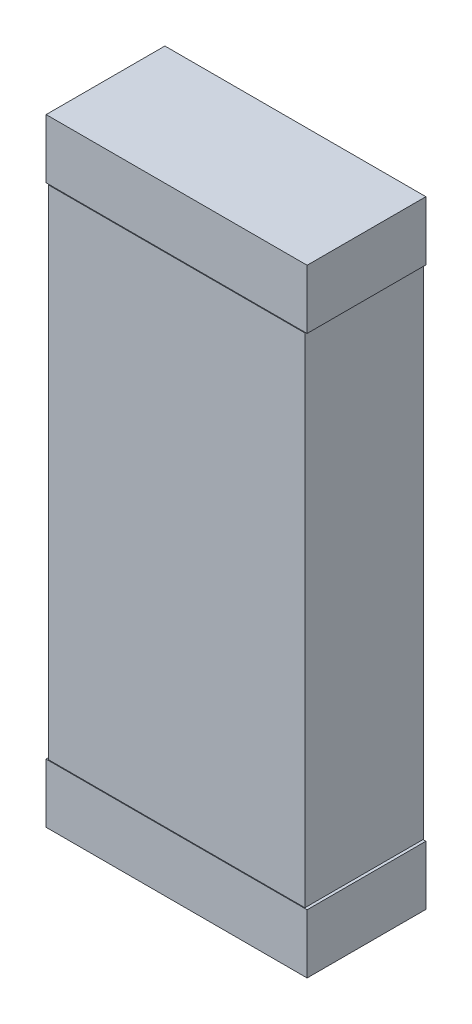
ISO-10303-21;
HEADER;
FILE_DESCRIPTION(('STEP AP214'),'2;1');
FILE_NAME('part.step','',(''),(''),'','','');
FILE_SCHEMA(('AUTOMOTIVE_DESIGN { 1 0 10303 214 1 1 1 1 }'));
ENDSEC;
DATA;
#1=APPLICATION_CONTEXT('core data for automotive mechanical design processes');
#2=APPLICATION_PROTOCOL_DEFINITION('international standard','automotive_design',2000,#1);
#3=PRODUCT_CONTEXT('',#1,'mechanical');
#4=PRODUCT('Part','Part','',(#3));
#5=PRODUCT_RELATED_PRODUCT_CATEGORY('part','',(#4));
#6=PRODUCT_DEFINITION_FORMATION('','',#4);
#7=PRODUCT_DEFINITION_CONTEXT('part definition',#1,'design');
#8=PRODUCT_DEFINITION('design','',#6,#7);
#9=PRODUCT_DEFINITION_SHAPE('','',#8);
#10=(LENGTH_UNIT() NAMED_UNIT(*) SI_UNIT(.MILLI.,.METRE.));
#11=(NAMED_UNIT(*) PLANE_ANGLE_UNIT() SI_UNIT($,.RADIAN.));
#12=(NAMED_UNIT(*) SI_UNIT($,.STERADIAN.) SOLID_ANGLE_UNIT());
#13=UNCERTAINTY_MEASURE_WITH_UNIT(LENGTH_MEASURE(1.E-05),#10,'distance_accuracy_value','');
#14=(GEOMETRIC_REPRESENTATION_CONTEXT(3) GLOBAL_UNCERTAINTY_ASSIGNED_CONTEXT((#13)) GLOBAL_UNIT_ASSIGNED_CONTEXT((#10,
#11,#12)) REPRESENTATION_CONTEXT('',''));
#15=CARTESIAN_POINT('',(0.,0.,0.));
#16=DIRECTION('',(0.,0.,1.));
#17=DIRECTION('',(1.,0.,0.));
#18=AXIS2_PLACEMENT_3D('',#15,#16,#17);
#19=CARTESIAN_POINT('',(19.4822064,0.19180048,0.4127));
#20=DIRECTION('',(0.,0.,1.));
#21=DIRECTION('',(1.,0.,0.));
#22=AXIS2_PLACEMENT_3D('',#19,#20,#21);
#23=PLANE('',#22);
#24=DIRECTION('',(1.,0.,0.));
#25=VECTOR('',#24,1.);
#26=CARTESIAN_POINT('',(18.6178444,1.86820048,0.4127));
#27=LINE('',#26,#25);
#28=CARTESIAN_POINT('',(18.6178444,1.86820048,0.4127));
#29=VERTEX_POINT('',#28);
#30=CARTESIAN_POINT('',(19.4822064,1.86820048,0.4127));
#31=VERTEX_POINT('',#30);
#32=EDGE_CURVE('P0_E58',#29,#31,#27,.T.);
#33=ORIENTED_EDGE('',*,*,#32,.F.);
#34=DIRECTION('',(0.,1.,0.));
#35=VECTOR('',#34,1.);
#36=CARTESIAN_POINT('',(18.6178444,0.19180048,0.4127));
#37=LINE('',#36,#35);
#38=CARTESIAN_POINT('',(18.6178444,0.19180048,0.4127));
#39=VERTEX_POINT('',#38);
#40=EDGE_CURVE('P0_E53',#39,#29,#37,.T.);
#41=ORIENTED_EDGE('',*,*,#40,.F.);
#42=DIRECTION('',(1.,0.,0.));
#43=VECTOR('',#42,1.);
#44=CARTESIAN_POINT('',(19.4822064,0.19180048,0.4127));
#45=LINE('',#44,#43);
#46=CARTESIAN_POINT('',(19.4822064,0.19180048,0.4127));
#47=VERTEX_POINT('',#46);
#48=EDGE_CURVE('P0_E68',#47,#39,#45,.F.);
#49=ORIENTED_EDGE('',*,*,#48,.F.);
#50=DIRECTION('',(0.,1.,0.));
#51=VECTOR('',#50,1.);
#52=CARTESIAN_POINT('',(19.4822064,1.86820048,0.4127));
#53=LINE('',#52,#51);
#54=EDGE_CURVE('P0_E20',#31,#47,#53,.F.);
#55=ORIENTED_EDGE('',*,*,#54,.F.);
#56=EDGE_LOOP('',(#33,#41,#49,#55));
#57=FACE_BOUND('',#56,.T.);
#58=ADVANCED_FACE('P0_F17',(#57),#23,.T.);
#59=CARTESIAN_POINT('',(19.4822064,1.86820048,0.0127));
#60=DIRECTION('',(1.,0.,0.));
#61=DIRECTION('',(0.,0.,-1.));
#62=AXIS2_PLACEMENT_3D('',#59,#60,#61);
#63=PLANE('',#62);
#64=DIRECTION('',(0.,0.,-1.));
#65=VECTOR('',#64,1.);
#66=CARTESIAN_POINT('',(19.4822064,0.19180048,0.0127));
#67=LINE('',#66,#65);
#68=CARTESIAN_POINT('',(19.4822064,0.19180048,0.0127));
#69=VERTEX_POINT('',#68);
#70=EDGE_CURVE('P0_E79',#69,#47,#67,.F.);
#71=ORIENTED_EDGE('',*,*,#70,.F.);
#72=DIRECTION('',(0.,1.,0.));
#73=VECTOR('',#72,1.);
#74=CARTESIAN_POINT('',(19.4822064,0.19180048,0.0127));
#75=LINE('',#74,#73);
#76=CARTESIAN_POINT('',(19.4822064,1.86820048,0.0127));
#77=VERTEX_POINT('',#76);
#78=EDGE_CURVE('P0_E74',#69,#77,#75,.T.);
#79=ORIENTED_EDGE('',*,*,#78,.T.);
#80=DIRECTION('',(0.,0.,1.));
#81=VECTOR('',#80,1.);
#82=CARTESIAN_POINT('',(19.4822064,1.86820048,0.0127));
#83=LINE('',#82,#81);
#84=EDGE_CURVE('P0_E63',#31,#77,#83,.F.);
#85=ORIENTED_EDGE('',*,*,#84,.F.);
#86=ORIENTED_EDGE('',*,*,#54,.T.);
#87=EDGE_LOOP('',(#71,#79,#85,#86));
#88=FACE_BOUND('',#87,.T.);
#89=ADVANCED_FACE('P0_F73',(#88),#63,.T.);
#90=CARTESIAN_POINT('',(18.6178444,1.86820048,0.0127));
#91=DIRECTION('',(0.,1.,0.));
#92=DIRECTION('',(0.,0.,1.));
#93=AXIS2_PLACEMENT_3D('',#90,#91,#92);
#94=PLANE('',#93);
#95=ORIENTED_EDGE('',*,*,#84,.T.);
#96=DIRECTION('',(1.,0.,0.));
#97=VECTOR('',#96,1.);
#98=CARTESIAN_POINT('',(19.4822064,1.86820048,0.0127));
#99=LINE('',#98,#97);
#100=CARTESIAN_POINT('',(18.6178444,1.86820048,0.0127));
#101=VERTEX_POINT('',#100);
#102=EDGE_CURVE('P0_E84',#77,#101,#99,.F.);
#103=ORIENTED_EDGE('',*,*,#102,.T.);
#104=DIRECTION('',(0.,0.,1.));
#105=VECTOR('',#104,1.);
#106=CARTESIAN_POINT('',(18.6178444,1.86820048,0.0127));
#107=LINE('',#106,#105);
#108=EDGE_CURVE('P0_E65',#29,#101,#107,.F.);
#109=ORIENTED_EDGE('',*,*,#108,.F.);
#110=ORIENTED_EDGE('',*,*,#32,.T.);
#111=EDGE_LOOP('',(#95,#103,#109,#110));
#112=FACE_BOUND('',#111,.T.);
#113=ADVANCED_FACE('P0_F60',(#112),#94,.T.);
#114=CARTESIAN_POINT('',(18.6178444,0.19180048,0.0127));
#115=DIRECTION('',(-1.,0.,0.));
#116=DIRECTION('',(0.,0.,1.));
#117=AXIS2_PLACEMENT_3D('',#114,#115,#116);
#118=PLANE('',#117);
#119=ORIENTED_EDGE('',*,*,#108,.T.);
#120=DIRECTION('',(0.,1.,0.));
#121=VECTOR('',#120,1.);
#122=CARTESIAN_POINT('',(18.6178444,0.19180048,0.0127));
#123=LINE('',#122,#121);
#124=CARTESIAN_POINT('',(18.6178444,0.19180048,0.0127));
#125=VERTEX_POINT('',#124);
#126=EDGE_CURVE('P0_E26',#101,#125,#123,.F.);
#127=ORIENTED_EDGE('',*,*,#126,.T.);
#128=DIRECTION('',(0.,0.,-1.));
#129=VECTOR('',#128,1.);
#130=CARTESIAN_POINT('',(18.6178444,0.19180048,0.0127));
#131=LINE('',#130,#129);
#132=EDGE_CURVE('P0_E34',#39,#125,#131,.T.);
#133=ORIENTED_EDGE('',*,*,#132,.F.);
#134=ORIENTED_EDGE('',*,*,#40,.T.);
#135=EDGE_LOOP('',(#119,#127,#133,#134));
#136=FACE_BOUND('',#135,.T.);
#137=ADVANCED_FACE('P0_F88',(#136),#118,.T.);
#138=CARTESIAN_POINT('',(19.4822064,0.19180048,0.0127));
#139=DIRECTION('',(0.,-1.,0.));
#140=DIRECTION('',(0.,0.,-1.));
#141=AXIS2_PLACEMENT_3D('',#138,#139,#140);
#142=PLANE('',#141);
#143=ORIENTED_EDGE('',*,*,#132,.T.);
#144=DIRECTION('',(1.,0.,0.));
#145=VECTOR('',#144,1.);
#146=CARTESIAN_POINT('',(19.4822064,0.19180048,0.0127));
#147=LINE('',#146,#145);
#148=EDGE_CURVE('P0_E11',#125,#69,#147,.T.);
#149=ORIENTED_EDGE('',*,*,#148,.T.);
#150=ORIENTED_EDGE('',*,*,#70,.T.);
#151=ORIENTED_EDGE('',*,*,#48,.T.);
#152=EDGE_LOOP('',(#143,#149,#150,#151));
#153=FACE_BOUND('',#152,.T.);
#154=ADVANCED_FACE('P0_F91',(#153),#142,.T.);
#155=CARTESIAN_POINT('',(19.4822064,0.19180048,0.0127));
#156=DIRECTION('',(0.,0.,1.));
#157=DIRECTION('',(1.,0.,0.));
#158=AXIS2_PLACEMENT_3D('',#155,#156,#157);
#159=PLANE('',#158);
#160=ORIENTED_EDGE('',*,*,#126,.F.);
#161=ORIENTED_EDGE('',*,*,#102,.F.);
#162=ORIENTED_EDGE('',*,*,#78,.F.);
#163=ORIENTED_EDGE('',*,*,#148,.F.);
#164=EDGE_LOOP('',(#160,#161,#162,#163));
#165=FACE_BOUND('',#164,.T.);
#166=ADVANCED_FACE('P0_F90',(#165),#159,.F.);
#167=CLOSED_SHELL('',(#58,#89,#113,#137,#154,#166));
#168=MANIFOLD_SOLID_BREP('P0_B1',#167);
#169=CARTESIAN_POINT('',(18.61050888,2.06949294,0.0127));
#170=DIRECTION('',(0.,1.,0.));
#171=DIRECTION('',(0.,0.,1.));
#172=AXIS2_PLACEMENT_3D('',#169,#170,#171);
#173=PLANE('',#172);
#174=DIRECTION('',(0.,0.,-1.));
#175=VECTOR('',#174,1.);
#176=CARTESIAN_POINT('',(19.48949112,2.06949294,0.0127));
#177=LINE('',#176,#175);
#178=CARTESIAN_POINT('',(19.48949112,2.06949294,0.0127));
#179=VERTEX_POINT('',#178);
#180=CARTESIAN_POINT('',(19.48949112,2.06949294,0.4127));
#181=VERTEX_POINT('',#180);
#182=EDGE_CURVE('P1_E20',#179,#181,#177,.F.);
#183=ORIENTED_EDGE('',*,*,#182,.F.);
#184=DIRECTION('',(1.,0.,0.));
#185=VECTOR('',#184,1.);
#186=CARTESIAN_POINT('',(19.48949112,2.06949294,0.0127));
#187=LINE('',#186,#185);
#188=CARTESIAN_POINT('',(18.61050888,2.06949294,0.0127));
#189=VERTEX_POINT('',#188);
#190=EDGE_CURVE('P1_E80',#179,#189,#187,.F.);
#191=ORIENTED_EDGE('',*,*,#190,.T.);
#192=DIRECTION('',(0.,0.,1.));
#193=VECTOR('',#192,1.);
#194=CARTESIAN_POINT('',(18.61050888,2.06949294,0.0127));
#195=LINE('',#194,#193);
#196=CARTESIAN_POINT('',(18.61050888,2.06949294,0.4127));
#197=VERTEX_POINT('',#196);
#198=EDGE_CURVE('P1_E68',#197,#189,#195,.F.);
#199=ORIENTED_EDGE('',*,*,#198,.F.);
#200=DIRECTION('',(1.,0.,0.));
#201=VECTOR('',#200,1.);
#202=CARTESIAN_POINT('',(19.48949112,2.06949294,0.4127));
#203=LINE('',#202,#201);
#204=EDGE_CURVE('P1_E56',#181,#197,#203,.F.);
#205=ORIENTED_EDGE('',*,*,#204,.F.);
#206=EDGE_LOOP('',(#183,#191,#199,#205));
#207=FACE_BOUND('',#206,.T.);
#208=ADVANCED_FACE('P1_F17',(#207),#173,.T.);
#209=CARTESIAN_POINT('',(19.48949112,2.06949294,0.0127));
#210=DIRECTION('',(1.,0.,0.));
#211=DIRECTION('',(0.,0.,-1.));
#212=AXIS2_PLACEMENT_3D('',#209,#210,#211);
#213=PLANE('',#212);
#214=DIRECTION('',(0.,0.,-1.));
#215=VECTOR('',#214,1.);
#216=CARTESIAN_POINT('',(19.48949112,1.87050934,0.0127));
#217=LINE('',#216,#215);
#218=CARTESIAN_POINT('',(19.48949112,1.87050934,0.0127));
#219=VERTEX_POINT('',#218);
#220=CARTESIAN_POINT('',(19.48949112,1.87050934,0.4127));
#221=VERTEX_POINT('',#220);
#222=EDGE_CURVE('P1_E83',#219,#221,#217,.F.);
#223=ORIENTED_EDGE('',*,*,#222,.F.);
#224=DIRECTION('',(0.,1.,0.));
#225=VECTOR('',#224,1.);
#226=CARTESIAN_POINT('',(19.48949112,1.87050934,0.0127));
#227=LINE('',#226,#225);
#228=EDGE_CURVE('P1_E65',#219,#179,#227,.T.);
#229=ORIENTED_EDGE('',*,*,#228,.T.);
#230=ORIENTED_EDGE('',*,*,#182,.T.);
#231=DIRECTION('',(0.,1.,0.));
#232=VECTOR('',#231,1.);
#233=CARTESIAN_POINT('',(19.48949112,1.87050934,0.4127));
#234=LINE('',#233,#232);
#235=EDGE_CURVE('P1_E62',#221,#181,#234,.T.);
#236=ORIENTED_EDGE('',*,*,#235,.F.);
#237=EDGE_LOOP('',(#223,#229,#230,#236));
#238=FACE_BOUND('',#237,.T.);
#239=ADVANCED_FACE('P1_F61',(#238),#213,.T.);
#240=CARTESIAN_POINT('',(19.48949112,1.87050934,0.4127));
#241=DIRECTION('',(0.,0.,1.));
#242=DIRECTION('',(1.,0.,0.));
#243=AXIS2_PLACEMENT_3D('',#240,#241,#242);
#244=PLANE('',#243);
#245=ORIENTED_EDGE('',*,*,#204,.T.);
#246=DIRECTION('',(0.,1.,0.));
#247=VECTOR('',#246,1.);
#248=CARTESIAN_POINT('',(18.61050888,1.87050934,0.4127));
#249=LINE('',#248,#247);
#250=CARTESIAN_POINT('',(18.61050888,1.87050934,0.4127));
#251=VERTEX_POINT('',#250);
#252=EDGE_CURVE('P1_E70',#251,#197,#249,.T.);
#253=ORIENTED_EDGE('',*,*,#252,.F.);
#254=DIRECTION('',(1.,0.,0.));
#255=VECTOR('',#254,1.);
#256=CARTESIAN_POINT('',(19.48949112,1.87050934,0.4127));
#257=LINE('',#256,#255);
#258=EDGE_CURVE('P1_E74',#221,#251,#257,.F.);
#259=ORIENTED_EDGE('',*,*,#258,.F.);
#260=ORIENTED_EDGE('',*,*,#235,.T.);
#261=EDGE_LOOP('',(#245,#253,#259,#260));
#262=FACE_BOUND('',#261,.T.);
#263=ADVANCED_FACE('P1_F72',(#262),#244,.T.);
#264=CARTESIAN_POINT('',(18.61050888,1.87050934,0.0127));
#265=DIRECTION('',(-1.,0.,0.));
#266=DIRECTION('',(0.,0.,1.));
#267=AXIS2_PLACEMENT_3D('',#264,#265,#266);
#268=PLANE('',#267);
#269=ORIENTED_EDGE('',*,*,#198,.T.);
#270=DIRECTION('',(0.,1.,0.));
#271=VECTOR('',#270,1.);
#272=CARTESIAN_POINT('',(18.61050888,1.87050934,0.0127));
#273=LINE('',#272,#271);
#274=CARTESIAN_POINT('',(18.61050888,1.87050934,0.0127));
#275=VERTEX_POINT('',#274);
#276=EDGE_CURVE('P1_E35',#189,#275,#273,.F.);
#277=ORIENTED_EDGE('',*,*,#276,.T.);
#278=DIRECTION('',(0.,0.,-1.));
#279=VECTOR('',#278,1.);
#280=CARTESIAN_POINT('',(18.61050888,1.87050934,0.0127));
#281=LINE('',#280,#279);
#282=EDGE_CURVE('P1_E26',#251,#275,#281,.T.);
#283=ORIENTED_EDGE('',*,*,#282,.F.);
#284=ORIENTED_EDGE('',*,*,#252,.T.);
#285=EDGE_LOOP('',(#269,#277,#283,#284));
#286=FACE_BOUND('',#285,.T.);
#287=ADVANCED_FACE('P1_F89',(#286),#268,.T.);
#288=CARTESIAN_POINT('',(19.48949112,1.87050934,0.0127));
#289=DIRECTION('',(0.,0.,1.));
#290=DIRECTION('',(1.,0.,0.));
#291=AXIS2_PLACEMENT_3D('',#288,#289,#290);
#292=PLANE('',#291);
#293=ORIENTED_EDGE('',*,*,#276,.F.);
#294=ORIENTED_EDGE('',*,*,#190,.F.);
#295=ORIENTED_EDGE('',*,*,#228,.F.);
#296=DIRECTION('',(1.,0.,0.));
#297=VECTOR('',#296,1.);
#298=CARTESIAN_POINT('',(19.48949112,1.87050934,0.0127));
#299=LINE('',#298,#297);
#300=EDGE_CURVE('P1_E11',#275,#219,#299,.T.);
#301=ORIENTED_EDGE('',*,*,#300,.F.);
#302=EDGE_LOOP('',(#293,#294,#295,#301));
#303=FACE_BOUND('',#302,.T.);
#304=ADVANCED_FACE('P1_F91',(#303),#292,.F.);
#305=CARTESIAN_POINT('',(19.48949112,1.87050934,0.0127));
#306=DIRECTION('',(0.,-1.,0.));
#307=DIRECTION('',(0.,0.,-1.));
#308=AXIS2_PLACEMENT_3D('',#305,#306,#307);
#309=PLANE('',#308);
#310=ORIENTED_EDGE('',*,*,#282,.T.);
#311=ORIENTED_EDGE('',*,*,#300,.T.);
#312=ORIENTED_EDGE('',*,*,#222,.T.);
#313=ORIENTED_EDGE('',*,*,#258,.T.);
#314=EDGE_LOOP('',(#310,#311,#312,#313));
#315=FACE_BOUND('',#314,.T.);
#316=ADVANCED_FACE('P1_F88',(#315),#309,.T.);
#317=CLOSED_SHELL('',(#208,#239,#263,#287,#304,#316));
#318=MANIFOLD_SOLID_BREP('P1_B1',#317);
#319=CARTESIAN_POINT('',(18.61050888,0.18949162,0.0127));
#320=DIRECTION('',(0.,1.,0.));
#321=DIRECTION('',(0.,0.,1.));
#322=AXIS2_PLACEMENT_3D('',#319,#320,#321);
#323=PLANE('',#322);
#324=DIRECTION('',(0.,0.,-1.));
#325=VECTOR('',#324,1.);
#326=CARTESIAN_POINT('',(19.48949112,0.18949162,0.0127));
#327=LINE('',#326,#325);
#328=CARTESIAN_POINT('',(19.48949112,0.18949162,0.0127));
#329=VERTEX_POINT('',#328);
#330=CARTESIAN_POINT('',(19.48949112,0.18949162,0.4127));
#331=VERTEX_POINT('',#330);
#332=EDGE_CURVE('P2_E20',#329,#331,#327,.F.);
#333=ORIENTED_EDGE('',*,*,#332,.F.);
#334=DIRECTION('',(1.,0.,0.));
#335=VECTOR('',#334,1.);
#336=CARTESIAN_POINT('',(19.48949112,0.18949162,0.0127));
#337=LINE('',#336,#335);
#338=CARTESIAN_POINT('',(18.61050888,0.18949162,0.0127));
#339=VERTEX_POINT('',#338);
#340=EDGE_CURVE('P2_E80',#329,#339,#337,.F.);
#341=ORIENTED_EDGE('',*,*,#340,.T.);
#342=DIRECTION('',(0.,0.,1.));
#343=VECTOR('',#342,1.);
#344=CARTESIAN_POINT('',(18.61050888,0.18949162,0.0127));
#345=LINE('',#344,#343);
#346=CARTESIAN_POINT('',(18.61050888,0.18949162,0.4127));
#347=VERTEX_POINT('',#346);
#348=EDGE_CURVE('P2_E68',#347,#339,#345,.F.);
#349=ORIENTED_EDGE('',*,*,#348,.F.);
#350=DIRECTION('',(1.,0.,0.));
#351=VECTOR('',#350,1.);
#352=CARTESIAN_POINT('',(19.48949112,0.18949162,0.4127));
#353=LINE('',#352,#351);
#354=EDGE_CURVE('P2_E56',#331,#347,#353,.F.);
#355=ORIENTED_EDGE('',*,*,#354,.F.);
#356=EDGE_LOOP('',(#333,#341,#349,#355));
#357=FACE_BOUND('',#356,.T.);
#358=ADVANCED_FACE('P2_F17',(#357),#323,.T.);
#359=CARTESIAN_POINT('',(19.48949112,0.18949162,0.0127));
#360=DIRECTION('',(1.,0.,0.));
#361=DIRECTION('',(0.,0.,-1.));
#362=AXIS2_PLACEMENT_3D('',#359,#360,#361);
#363=PLANE('',#362);
#364=DIRECTION('',(0.,0.,-1.));
#365=VECTOR('',#364,1.);
#366=CARTESIAN_POINT('',(19.48949112,-0.00949198,0.0127));
#367=LINE('',#366,#365);
#368=CARTESIAN_POINT('',(19.48949112,-0.00949198,0.0127));
#369=VERTEX_POINT('',#368);
#370=CARTESIAN_POINT('',(19.48949112,-0.00949198,0.4127));
#371=VERTEX_POINT('',#370);
#372=EDGE_CURVE('P2_E83',#369,#371,#367,.F.);
#373=ORIENTED_EDGE('',*,*,#372,.F.);
#374=DIRECTION('',(0.,1.,0.));
#375=VECTOR('',#374,1.);
#376=CARTESIAN_POINT('',(19.48949112,-0.00949198,0.0127));
#377=LINE('',#376,#375);
#378=EDGE_CURVE('P2_E65',#369,#329,#377,.T.);
#379=ORIENTED_EDGE('',*,*,#378,.T.);
#380=ORIENTED_EDGE('',*,*,#332,.T.);
#381=DIRECTION('',(0.,1.,0.));
#382=VECTOR('',#381,1.);
#383=CARTESIAN_POINT('',(19.48949112,-0.00949198,0.4127));
#384=LINE('',#383,#382);
#385=EDGE_CURVE('P2_E62',#371,#331,#384,.T.);
#386=ORIENTED_EDGE('',*,*,#385,.F.);
#387=EDGE_LOOP('',(#373,#379,#380,#386));
#388=FACE_BOUND('',#387,.T.);
#389=ADVANCED_FACE('P2_F61',(#388),#363,.T.);
#390=CARTESIAN_POINT('',(19.48949112,-0.00949198,0.4127));
#391=DIRECTION('',(0.,0.,1.));
#392=DIRECTION('',(1.,0.,0.));
#393=AXIS2_PLACEMENT_3D('',#390,#391,#392);
#394=PLANE('',#393);
#395=ORIENTED_EDGE('',*,*,#354,.T.);
#396=DIRECTION('',(0.,1.,0.));
#397=VECTOR('',#396,1.);
#398=CARTESIAN_POINT('',(18.61050888,-0.00949198,0.4127));
#399=LINE('',#398,#397);
#400=CARTESIAN_POINT('',(18.61050888,-0.00949198,0.4127));
#401=VERTEX_POINT('',#400);
#402=EDGE_CURVE('P2_E70',#401,#347,#399,.T.);
#403=ORIENTED_EDGE('',*,*,#402,.F.);
#404=DIRECTION('',(1.,0.,0.));
#405=VECTOR('',#404,1.);
#406=CARTESIAN_POINT('',(19.48949112,-0.00949198,0.4127));
#407=LINE('',#406,#405);
#408=EDGE_CURVE('P2_E74',#371,#401,#407,.F.);
#409=ORIENTED_EDGE('',*,*,#408,.F.);
#410=ORIENTED_EDGE('',*,*,#385,.T.);
#411=EDGE_LOOP('',(#395,#403,#409,#410));
#412=FACE_BOUND('',#411,.T.);
#413=ADVANCED_FACE('P2_F72',(#412),#394,.T.);
#414=CARTESIAN_POINT('',(18.61050888,-0.00949198,0.0127));
#415=DIRECTION('',(-1.,0.,0.));
#416=DIRECTION('',(0.,0.,1.));
#417=AXIS2_PLACEMENT_3D('',#414,#415,#416);
#418=PLANE('',#417);
#419=ORIENTED_EDGE('',*,*,#348,.T.);
#420=DIRECTION('',(0.,1.,0.));
#421=VECTOR('',#420,1.);
#422=CARTESIAN_POINT('',(18.61050888,-0.00949198,0.0127));
#423=LINE('',#422,#421);
#424=CARTESIAN_POINT('',(18.61050888,-0.00949198,0.0127));
#425=VERTEX_POINT('',#424);
#426=EDGE_CURVE('P2_E35',#339,#425,#423,.F.);
#427=ORIENTED_EDGE('',*,*,#426,.T.);
#428=DIRECTION('',(0.,0.,-1.));
#429=VECTOR('',#428,1.);
#430=CARTESIAN_POINT('',(18.61050888,-0.00949198,0.0127));
#431=LINE('',#430,#429);
#432=EDGE_CURVE('P2_E26',#401,#425,#431,.T.);
#433=ORIENTED_EDGE('',*,*,#432,.F.);
#434=ORIENTED_EDGE('',*,*,#402,.T.);
#435=EDGE_LOOP('',(#419,#427,#433,#434));
#436=FACE_BOUND('',#435,.T.);
#437=ADVANCED_FACE('P2_F89',(#436),#418,.T.);
#438=CARTESIAN_POINT('',(19.48949112,-0.00949198,0.0127));
#439=DIRECTION('',(0.,0.,1.));
#440=DIRECTION('',(1.,0.,0.));
#441=AXIS2_PLACEMENT_3D('',#438,#439,#440);
#442=PLANE('',#441);
#443=ORIENTED_EDGE('',*,*,#426,.F.);
#444=ORIENTED_EDGE('',*,*,#340,.F.);
#445=ORIENTED_EDGE('',*,*,#378,.F.);
#446=DIRECTION('',(1.,0.,0.));
#447=VECTOR('',#446,1.);
#448=CARTESIAN_POINT('',(19.48949112,-0.00949198,0.0127));
#449=LINE('',#448,#447);
#450=EDGE_CURVE('P2_E11',#425,#369,#449,.T.);
#451=ORIENTED_EDGE('',*,*,#450,.F.);
#452=EDGE_LOOP('',(#443,#444,#445,#451));
#453=FACE_BOUND('',#452,.T.);
#454=ADVANCED_FACE('P2_F91',(#453),#442,.F.);
#455=CARTESIAN_POINT('',(19.48949112,-0.00949198,0.0127));
#456=DIRECTION('',(0.,-1.,0.));
#457=DIRECTION('',(0.,0.,-1.));
#458=AXIS2_PLACEMENT_3D('',#455,#456,#457);
#459=PLANE('',#458);
#460=ORIENTED_EDGE('',*,*,#432,.T.);
#461=ORIENTED_EDGE('',*,*,#450,.T.);
#462=ORIENTED_EDGE('',*,*,#372,.T.);
#463=ORIENTED_EDGE('',*,*,#408,.T.);
#464=EDGE_LOOP('',(#460,#461,#462,#463));
#465=FACE_BOUND('',#464,.T.);
#466=ADVANCED_FACE('P2_F88',(#465),#459,.T.);
#467=CLOSED_SHELL('',(#358,#389,#413,#437,#454,#466));
#468=MANIFOLD_SOLID_BREP('P2_B1',#467);
#469=ADVANCED_BREP_SHAPE_REPRESENTATION('',(#18,#168,#318,#468),#14);
#470=SHAPE_DEFINITION_REPRESENTATION(#9,#469);
ENDSEC;
END-ISO-10303-21;
